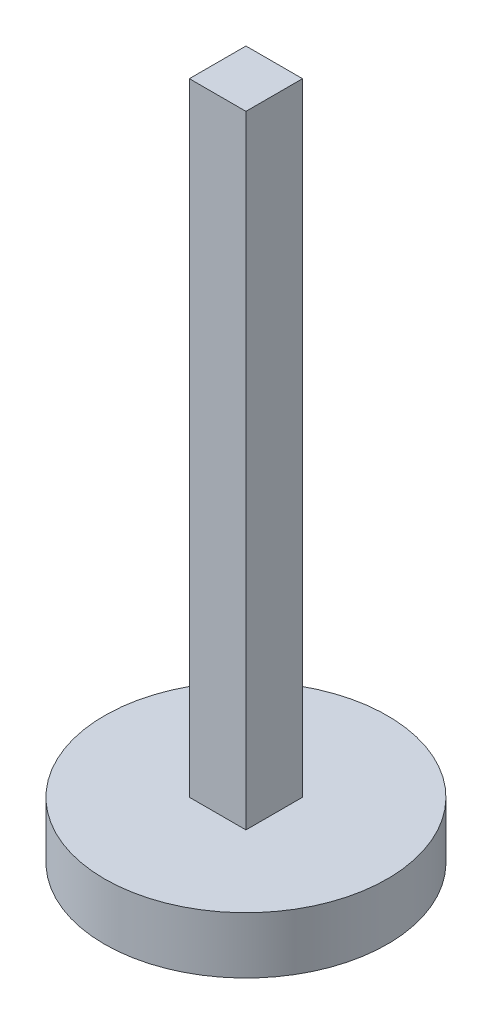
ISO-10303-21;
HEADER;
FILE_DESCRIPTION(('STEP AP214'),'2;1');
FILE_NAME('part.step','',(''),(''),'','','');
FILE_SCHEMA(('AUTOMOTIVE_DESIGN { 1 0 10303 214 1 1 1 1 }'));
ENDSEC;
DATA;
#1=APPLICATION_CONTEXT('core data for automotive mechanical design processes');
#2=APPLICATION_PROTOCOL_DEFINITION('international standard','automotive_design',2000,#1);
#3=PRODUCT_CONTEXT('',#1,'mechanical');
#4=PRODUCT('Part','Part','',(#3));
#5=PRODUCT_RELATED_PRODUCT_CATEGORY('part','',(#4));
#6=PRODUCT_DEFINITION_FORMATION('','',#4);
#7=PRODUCT_DEFINITION_CONTEXT('part definition',#1,'design');
#8=PRODUCT_DEFINITION('design','',#6,#7);
#9=PRODUCT_DEFINITION_SHAPE('','',#8);
#10=(LENGTH_UNIT() NAMED_UNIT(*) SI_UNIT(.MILLI.,.METRE.));
#11=(NAMED_UNIT(*) PLANE_ANGLE_UNIT() SI_UNIT($,.RADIAN.));
#12=(NAMED_UNIT(*) SI_UNIT($,.STERADIAN.) SOLID_ANGLE_UNIT());
#13=UNCERTAINTY_MEASURE_WITH_UNIT(LENGTH_MEASURE(1.E-05),#10,'distance_accuracy_value','');
#14=(GEOMETRIC_REPRESENTATION_CONTEXT(3) GLOBAL_UNCERTAINTY_ASSIGNED_CONTEXT((#13)) GLOBAL_UNIT_ASSIGNED_CONTEXT((#10,
#11,#12)) REPRESENTATION_CONTEXT('',''));
#15=CARTESIAN_POINT('',(0.,0.,0.));
#16=DIRECTION('',(0.,0.,1.));
#17=DIRECTION('',(1.,0.,0.));
#18=AXIS2_PLACEMENT_3D('',#15,#16,#17);
#19=CARTESIAN_POINT('',(0.,20.,0.));
#20=DIRECTION('',(0.,1.,0.));
#21=DIRECTION('',(0.,0.,1.));
#22=AXIS2_PLACEMENT_3D('',#19,#20,#21);
#23=PLANE('',#22);
#24=CARTESIAN_POINT('',(0.,20.,0.));
#25=DIRECTION('',(0.,1.,0.));
#26=DIRECTION('',(0.,0.,1.));
#27=AXIS2_PLACEMENT_3D('',#24,#25,#26);
#28=CIRCLE('',#27,50.);
#29=CARTESIAN_POINT('',(0.,20.,50.));
#30=VERTEX_POINT('',#29);
#31=EDGE_CURVE('E11',#30,#30,#28,.T.);
#32=ORIENTED_EDGE('',*,*,#31,.T.);
#33=EDGE_LOOP('',(#32));
#34=FACE_BOUND('',#33,.T.);
#35=DIRECTION('',(-1.,0.,0.));
#36=VECTOR('',#35,1.);
#37=CARTESIAN_POINT('',(-10.,20.,-10.));
#38=LINE('',#37,#36);
#39=CARTESIAN_POINT('',(10.,20.,-10.));
#40=VERTEX_POINT('',#39);
#41=CARTESIAN_POINT('',(-10.,20.,-10.));
#42=VERTEX_POINT('',#41);
#43=EDGE_CURVE('E101',#40,#42,#38,.T.);
#44=ORIENTED_EDGE('',*,*,#43,.F.);
#45=DIRECTION('',(0.,0.,-1.));
#46=VECTOR('',#45,1.);
#47=CARTESIAN_POINT('',(10.,20.,9.99999999999999));
#48=LINE('',#47,#46);
#49=CARTESIAN_POINT('',(10.,20.,9.99999999999999));
#50=VERTEX_POINT('',#49);
#51=EDGE_CURVE('E52',#50,#40,#48,.T.);
#52=ORIENTED_EDGE('',*,*,#51,.F.);
#53=DIRECTION('',(1.,0.,0.));
#54=VECTOR('',#53,1.);
#55=CARTESIAN_POINT('',(-10.,20.,9.99999999999999));
#56=LINE('',#55,#54);
#57=CARTESIAN_POINT('',(-10.,20.,9.99999999999999));
#58=VERTEX_POINT('',#57);
#59=EDGE_CURVE('E99',#58,#50,#56,.T.);
#60=ORIENTED_EDGE('',*,*,#59,.F.);
#61=DIRECTION('',(0.,0.,1.));
#62=VECTOR('',#61,1.);
#63=CARTESIAN_POINT('',(-10.,20.,9.99999999999999));
#64=LINE('',#63,#62);
#65=EDGE_CURVE('E57',#42,#58,#64,.T.);
#66=ORIENTED_EDGE('',*,*,#65,.F.);
#67=EDGE_LOOP('',(#44,#52,#60,#66));
#68=FACE_BOUND('',#67,.T.);
#69=ADVANCED_FACE('F37',(#34,#68),#23,.T.);
#70=CARTESIAN_POINT('',(0.,0.,0.));
#71=DIRECTION('',(0.,1.,0.));
#72=DIRECTION('',(0.,0.,1.));
#73=AXIS2_PLACEMENT_3D('',#70,#71,#72);
#74=PLANE('',#73);
#75=CARTESIAN_POINT('',(0.,0.,0.));
#76=DIRECTION('',(0.,1.,0.));
#77=DIRECTION('',(0.,0.,1.));
#78=AXIS2_PLACEMENT_3D('',#75,#76,#77);
#79=CIRCLE('',#78,50.);
#80=CARTESIAN_POINT('',(0.,0.,50.));
#81=VERTEX_POINT('',#80);
#82=EDGE_CURVE('E41',#81,#81,#79,.T.);
#83=ORIENTED_EDGE('',*,*,#82,.F.);
#84=EDGE_LOOP('',(#83));
#85=FACE_BOUND('',#84,.T.);
#86=ADVANCED_FACE('F113',(#85),#74,.F.);
#87=CARTESIAN_POINT('',(0.,20.,0.));
#88=DIRECTION('',(0.,-1.,0.));
#89=DIRECTION('',(0.,0.,-1.));
#90=AXIS2_PLACEMENT_3D('',#87,#88,#89);
#91=CYLINDRICAL_SURFACE('',#90,50.);
#92=ORIENTED_EDGE('',*,*,#31,.F.);
#93=EDGE_LOOP('',(#92));
#94=FACE_BOUND('',#93,.T.);
#95=ORIENTED_EDGE('',*,*,#82,.T.);
#96=EDGE_LOOP('',(#95));
#97=FACE_BOUND('',#96,.T.);
#98=ADVANCED_FACE('F39',(#94,#97),#91,.T.);
#99=CARTESIAN_POINT('',(0.,240.,9.99999999999999));
#100=DIRECTION('',(0.,0.,-1.));
#101=DIRECTION('',(-1.,0.,0.));
#102=AXIS2_PLACEMENT_3D('',#99,#100,#101);
#103=PLANE('',#102);
#104=ORIENTED_EDGE('',*,*,#59,.T.);
#105=DIRECTION('',(0.,-1.,0.));
#106=VECTOR('',#105,1.);
#107=CARTESIAN_POINT('',(10.,240.,9.99999999999999));
#108=LINE('',#107,#106);
#109=CARTESIAN_POINT('',(10.,240.,9.99999999999999));
#110=VERTEX_POINT('',#109);
#111=EDGE_CURVE('E81',#110,#50,#108,.T.);
#112=ORIENTED_EDGE('',*,*,#111,.F.);
#113=DIRECTION('',(1.,0.,0.));
#114=VECTOR('',#113,1.);
#115=CARTESIAN_POINT('',(0.,240.,9.99999999999999));
#116=LINE('',#115,#114);
#117=CARTESIAN_POINT('',(-10.,240.,9.99999999999999));
#118=VERTEX_POINT('',#117);
#119=EDGE_CURVE('E88',#118,#110,#116,.T.);
#120=ORIENTED_EDGE('',*,*,#119,.F.);
#121=DIRECTION('',(0.,-1.,0.));
#122=VECTOR('',#121,1.);
#123=CARTESIAN_POINT('',(-10.,240.,9.99999999999999));
#124=LINE('',#123,#122);
#125=EDGE_CURVE('E186',#118,#58,#124,.T.);
#126=ORIENTED_EDGE('',*,*,#125,.T.);
#127=EDGE_LOOP('',(#104,#112,#120,#126));
#128=FACE_BOUND('',#127,.T.);
#129=ADVANCED_FACE('F98',(#128),#103,.F.);
#130=CARTESIAN_POINT('',(10.,240.,0.));
#131=DIRECTION('',(-1.,0.,0.));
#132=DIRECTION('',(0.,0.,1.));
#133=AXIS2_PLACEMENT_3D('',#130,#131,#132);
#134=PLANE('',#133);
#135=ORIENTED_EDGE('',*,*,#51,.T.);
#136=DIRECTION('',(0.,-1.,0.));
#137=VECTOR('',#136,1.);
#138=CARTESIAN_POINT('',(10.,240.,-10.));
#139=LINE('',#138,#137);
#140=CARTESIAN_POINT('',(10.,240.,-10.));
#141=VERTEX_POINT('',#140);
#142=EDGE_CURVE('E83',#141,#40,#139,.T.);
#143=ORIENTED_EDGE('',*,*,#142,.F.);
#144=DIRECTION('',(0.,0.,-1.));
#145=VECTOR('',#144,1.);
#146=CARTESIAN_POINT('',(10.,240.,0.));
#147=LINE('',#146,#145);
#148=EDGE_CURVE('E77',#110,#141,#147,.T.);
#149=ORIENTED_EDGE('',*,*,#148,.F.);
#150=ORIENTED_EDGE('',*,*,#111,.T.);
#151=EDGE_LOOP('',(#135,#143,#149,#150));
#152=FACE_BOUND('',#151,.T.);
#153=ADVANCED_FACE('F79',(#152),#134,.F.);
#154=CARTESIAN_POINT('',(0.,240.,-10.));
#155=DIRECTION('',(0.,0.,-1.));
#156=DIRECTION('',(-1.,0.,0.));
#157=AXIS2_PLACEMENT_3D('',#154,#155,#156);
#158=PLANE('',#157);
#159=ORIENTED_EDGE('',*,*,#142,.T.);
#160=ORIENTED_EDGE('',*,*,#43,.T.);
#161=DIRECTION('',(0.,-1.,0.));
#162=VECTOR('',#161,1.);
#163=CARTESIAN_POINT('',(-10.,240.,-10.));
#164=LINE('',#163,#162);
#165=CARTESIAN_POINT('',(-10.,240.,-10.));
#166=VERTEX_POINT('',#165);
#167=EDGE_CURVE('E103',#166,#42,#164,.T.);
#168=ORIENTED_EDGE('',*,*,#167,.F.);
#169=DIRECTION('',(1.,0.,0.));
#170=VECTOR('',#169,1.);
#171=CARTESIAN_POINT('',(0.,240.,-10.));
#172=LINE('',#171,#170);
#173=EDGE_CURVE('E87',#166,#141,#172,.T.);
#174=ORIENTED_EDGE('',*,*,#173,.T.);
#175=EDGE_LOOP('',(#159,#160,#168,#174));
#176=FACE_BOUND('',#175,.T.);
#177=ADVANCED_FACE('F127',(#176),#158,.T.);
#178=CARTESIAN_POINT('',(-10.,240.,0.));
#179=DIRECTION('',(-1.,0.,0.));
#180=DIRECTION('',(0.,0.,1.));
#181=AXIS2_PLACEMENT_3D('',#178,#179,#180);
#182=PLANE('',#181);
#183=ORIENTED_EDGE('',*,*,#167,.T.);
#184=ORIENTED_EDGE('',*,*,#65,.T.);
#185=ORIENTED_EDGE('',*,*,#125,.F.);
#186=DIRECTION('',(0.,0.,-1.));
#187=VECTOR('',#186,1.);
#188=CARTESIAN_POINT('',(-10.,240.,0.));
#189=LINE('',#188,#187);
#190=EDGE_CURVE('E94',#118,#166,#189,.T.);
#191=ORIENTED_EDGE('',*,*,#190,.T.);
#192=EDGE_LOOP('',(#183,#184,#185,#191));
#193=FACE_BOUND('',#192,.T.);
#194=ADVANCED_FACE('F130',(#193),#182,.T.);
#195=CARTESIAN_POINT('',(0.,240.,0.));
#196=DIRECTION('',(0.,1.,0.));
#197=DIRECTION('',(0.,0.,1.));
#198=AXIS2_PLACEMENT_3D('',#195,#196,#197);
#199=PLANE('',#198);
#200=ORIENTED_EDGE('',*,*,#119,.T.);
#201=ORIENTED_EDGE('',*,*,#148,.T.);
#202=ORIENTED_EDGE('',*,*,#173,.F.);
#203=ORIENTED_EDGE('',*,*,#190,.F.);
#204=EDGE_LOOP('',(#200,#201,#202,#203));
#205=FACE_BOUND('',#204,.T.);
#206=ADVANCED_FACE('F92',(#205),#199,.T.);
#207=CLOSED_SHELL('',(#69,#86,#98,#129,#153,#177,#194,#206));
#208=MANIFOLD_SOLID_BREP('B2',#207);
#209=ADVANCED_BREP_SHAPE_REPRESENTATION('',(#18,#208),#14);
#210=SHAPE_DEFINITION_REPRESENTATION(#9,#209);
ENDSEC;
END-ISO-10303-21;
